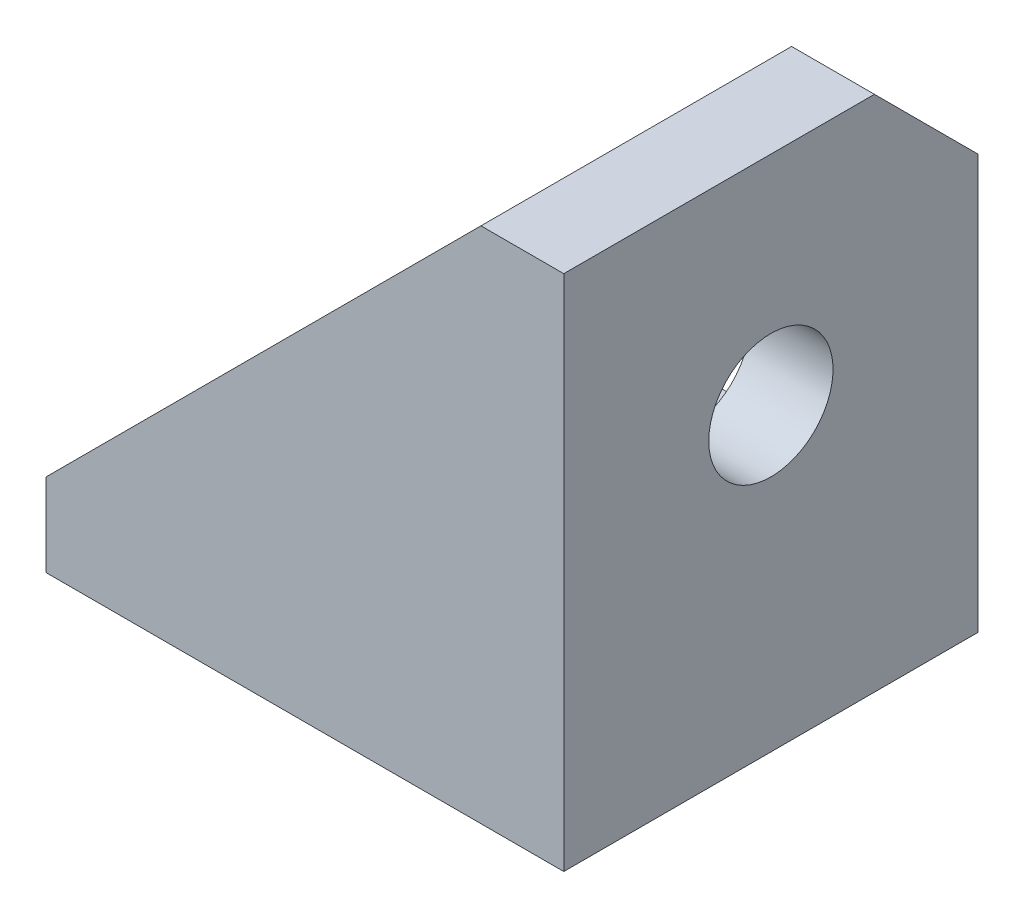
ISO-10303-21;
HEADER;
FILE_DESCRIPTION(('STEP AP214'),'2;1');
FILE_NAME('part.step','',(''),(''),'','','');
FILE_SCHEMA(('AUTOMOTIVE_DESIGN { 1 0 10303 214 1 1 1 1 }'));
ENDSEC;
DATA;
#1=APPLICATION_CONTEXT('core data for automotive mechanical design processes');
#2=APPLICATION_PROTOCOL_DEFINITION('international standard','automotive_design',2000,#1);
#3=PRODUCT_CONTEXT('',#1,'mechanical');
#4=PRODUCT('Part','Part','',(#3));
#5=PRODUCT_RELATED_PRODUCT_CATEGORY('part','',(#4));
#6=PRODUCT_DEFINITION_FORMATION('','',#4);
#7=PRODUCT_DEFINITION_CONTEXT('part definition',#1,'design');
#8=PRODUCT_DEFINITION('design','',#6,#7);
#9=PRODUCT_DEFINITION_SHAPE('','',#8);
#10=(LENGTH_UNIT() NAMED_UNIT(*) SI_UNIT(.MILLI.,.METRE.));
#11=(NAMED_UNIT(*) PLANE_ANGLE_UNIT() SI_UNIT($,.RADIAN.));
#12=(NAMED_UNIT(*) SI_UNIT($,.STERADIAN.) SOLID_ANGLE_UNIT());
#13=UNCERTAINTY_MEASURE_WITH_UNIT(LENGTH_MEASURE(1.E-05),#10,'distance_accuracy_value','');
#14=(GEOMETRIC_REPRESENTATION_CONTEXT(3) GLOBAL_UNCERTAINTY_ASSIGNED_CONTEXT((#13)) GLOBAL_UNIT_ASSIGNED_CONTEXT((#10,
#11,#12)) REPRESENTATION_CONTEXT('',''));
#15=CARTESIAN_POINT('',(0.,0.,0.));
#16=DIRECTION('',(0.,0.,1.));
#17=DIRECTION('',(1.,0.,0.));
#18=AXIS2_PLACEMENT_3D('',#15,#16,#17);
#19=CARTESIAN_POINT('',(-22.2500000000004,1010.,-9.00023424550686));
#20=DIRECTION('',(0.,-1.,0.));
#21=DIRECTION('',(0.,0.,1.));
#22=AXIS2_PLACEMENT_3D('',#19,#20,#21);
#23=PLANE('',#22);
#24=CARTESIAN_POINT('',(-32.75,1010.,0.999765754493011));
#25=DIRECTION('',(0.,1.,0.));
#26=DIRECTION('',(0.,0.,1.));
#27=AXIS2_PLACEMENT_3D('',#24,#25,#26);
#28=CIRCLE('',#27,2.99999999999999);
#29=CARTESIAN_POINT('',(-32.75,1010.,3.999765754493));
#30=VERTEX_POINT('',#29);
#31=EDGE_CURVE('E150',#30,#30,#28,.T.);
#32=ORIENTED_EDGE('',*,*,#31,.F.);
#33=EDGE_LOOP('',(#32));
#34=FACE_BOUND('',#33,.T.);
#35=DIRECTION('',(0.,0.,1.));
#36=VECTOR('',#35,1.);
#37=CARTESIAN_POINT('',(-43.25,1010.,-9.00023424550686));
#38=LINE('',#37,#36);
#39=CARTESIAN_POINT('',(-43.25,1010.,-4.00023424550683));
#40=VERTEX_POINT('',#39);
#41=CARTESIAN_POINT('',(-43.25,1010.,8.99976575449301));
#42=VERTEX_POINT('',#41);
#43=EDGE_CURVE('E156',#40,#42,#38,.T.);
#44=ORIENTED_EDGE('',*,*,#43,.T.);
#45=DIRECTION('',(1.,0.,0.));
#46=VECTOR('',#45,1.);
#47=CARTESIAN_POINT('',(-22.2500000000006,1010.,8.99976575449312));
#48=LINE('',#47,#46);
#49=CARTESIAN_POINT('',(-22.2500000000004,1010.,8.99976575449314));
#50=VERTEX_POINT('',#49);
#51=EDGE_CURVE('E137',#42,#50,#48,.T.);
#52=ORIENTED_EDGE('',*,*,#51,.T.);
#53=DIRECTION('',(0.,0.,1.));
#54=VECTOR('',#53,1.);
#55=CARTESIAN_POINT('',(-22.2500000000004,1010.,-9.00023424550686));
#56=LINE('',#55,#54);
#57=CARTESIAN_POINT('',(-22.2500000000004,1010.,-9.00023424550686));
#58=VERTEX_POINT('',#57);
#59=EDGE_CURVE('E159',#58,#50,#56,.T.);
#60=ORIENTED_EDGE('',*,*,#59,.F.);
#61=DIRECTION('',(-1.,0.,0.));
#62=VECTOR('',#61,1.);
#63=CARTESIAN_POINT('',(-22.2500000000004,1010.,-9.00023424550686));
#64=LINE('',#63,#62);
#65=CARTESIAN_POINT('',(-38.2499999999997,1010.,-9.00023424550686));
#66=VERTEX_POINT('',#65);
#67=EDGE_CURVE('E153',#58,#66,#64,.T.);
#68=ORIENTED_EDGE('',*,*,#67,.T.);
#69=DIRECTION('',(0.707106781186543,0.,-0.707106781186552));
#70=VECTOR('',#69,1.);
#71=CARTESIAN_POINT('',(-38.2499999999997,1010.,-9.00023424550684));
#72=LINE('',#71,#70);
#73=EDGE_CURVE('E43',#40,#66,#72,.T.);
#74=ORIENTED_EDGE('',*,*,#73,.F.);
#75=EDGE_LOOP('',(#44,#52,#60,#68,#74));
#76=FACE_BOUND('',#75,.T.);
#77=ADVANCED_FACE('F35',(#34,#76),#23,.F.);
#78=CARTESIAN_POINT('',(-22.2500000000004,1031.,-9.00023424550684));
#79=DIRECTION('',(1.,0.,0.));
#80=DIRECTION('',(0.,0.,1.));
#81=AXIS2_PLACEMENT_3D('',#78,#79,#80);
#82=PLANE('',#81);
#83=CARTESIAN_POINT('',(-22.2500000000004,1020.5,0.999765754493179));
#84=DIRECTION('',(-1.,0.,0.));
#85=DIRECTION('',(0.,0.,1.));
#86=AXIS2_PLACEMENT_3D('',#83,#84,#85);
#87=CIRCLE('',#86,2.99999999999989);
#88=CARTESIAN_POINT('',(-22.2500000000004,1020.5,3.99976575449307));
#89=VERTEX_POINT('',#88);
#90=EDGE_CURVE('E146',#89,#89,#87,.T.);
#91=ORIENTED_EDGE('',*,*,#90,.F.);
#92=EDGE_LOOP('',(#91));
#93=FACE_BOUND('',#92,.T.);
#94=DIRECTION('',(0.,-1.,0.));
#95=VECTOR('',#94,1.);
#96=CARTESIAN_POINT('',(-22.2500000000004,1031.,-9.00023424550684));
#97=LINE('',#96,#95);
#98=CARTESIAN_POINT('',(-22.2500000000004,1026.,-9.00023424550684));
#99=VERTEX_POINT('',#98);
#100=EDGE_CURVE('E151',#99,#58,#97,.T.);
#101=ORIENTED_EDGE('',*,*,#100,.T.);
#102=ORIENTED_EDGE('',*,*,#59,.T.);
#103=DIRECTION('',(0.,1.,0.));
#104=VECTOR('',#103,1.);
#105=CARTESIAN_POINT('',(-22.2500000000004,1031.,8.99976575449315));
#106=LINE('',#105,#104);
#107=CARTESIAN_POINT('',(-22.2500000000004,1031.,8.99976575449315));
#108=VERTEX_POINT('',#107);
#109=EDGE_CURVE('E172',#50,#108,#106,.T.);
#110=ORIENTED_EDGE('',*,*,#109,.T.);
#111=DIRECTION('',(0.,0.,1.));
#112=VECTOR('',#111,1.);
#113=CARTESIAN_POINT('',(-22.2500000000004,1031.,-9.00023424550684));
#114=LINE('',#113,#112);
#115=CARTESIAN_POINT('',(-22.2500000000004,1031.,-4.0002342455069));
#116=VERTEX_POINT('',#115);
#117=EDGE_CURVE('E162',#116,#108,#114,.T.);
#118=ORIENTED_EDGE('',*,*,#117,.F.);
#119=DIRECTION('',(0.,-0.707106781186546,-0.707106781186549));
#120=VECTOR('',#119,1.);
#121=CARTESIAN_POINT('',(-22.2500000000004,1031.,-4.0002342455069));
#122=LINE('',#121,#120);
#123=EDGE_CURVE('E190',#99,#116,#122,.F.);
#124=ORIENTED_EDGE('',*,*,#123,.F.);
#125=EDGE_LOOP('',(#101,#102,#110,#118,#124));
#126=FACE_BOUND('',#125,.T.);
#127=ADVANCED_FACE('F215',(#93,#126),#82,.F.);
#128=CARTESIAN_POINT('',(-43.2499999999996,1006.,-9.00023424550684));
#129=DIRECTION('',(0.,-1.,0.));
#130=DIRECTION('',(0.,0.,1.));
#131=AXIS2_PLACEMENT_3D('',#128,#129,#130);
#132=PLANE('',#131);
#133=DIRECTION('',(-1.,0.,0.));
#134=VECTOR('',#133,1.);
#135=CARTESIAN_POINT('',(-43.2499999999996,1006.,10.9997657544931));
#136=LINE('',#135,#134);
#137=CARTESIAN_POINT('',(-18.25,1006.,10.9997657544931));
#138=VERTEX_POINT('',#137);
#139=CARTESIAN_POINT('',(-43.2499999999996,1006.,10.9997657544931));
#140=VERTEX_POINT('',#139);
#141=EDGE_CURVE('E109',#138,#140,#136,.T.);
#142=ORIENTED_EDGE('',*,*,#141,.T.);
#143=DIRECTION('',(0.,0.,1.));
#144=VECTOR('',#143,1.);
#145=CARTESIAN_POINT('',(-43.2499999999996,1006.,-9.00023424550684));
#146=LINE('',#145,#144);
#147=CARTESIAN_POINT('',(-43.2499999999996,1006.,-4.00023424550684));
#148=VERTEX_POINT('',#147);
#149=EDGE_CURVE('E164',#148,#140,#146,.T.);
#150=ORIENTED_EDGE('',*,*,#149,.F.);
#151=DIRECTION('',(-0.707106781186543,0.,0.707106781186552));
#152=VECTOR('',#151,1.);
#153=CARTESIAN_POINT('',(-40.7499999999996,1006.,-6.50023424550687));
#154=LINE('',#153,#152);
#155=CARTESIAN_POINT('',(-38.2499999999997,1006.,-9.00023424550684));
#156=VERTEX_POINT('',#155);
#157=EDGE_CURVE('E184',#156,#148,#154,.T.);
#158=ORIENTED_EDGE('',*,*,#157,.F.);
#159=DIRECTION('',(1.,0.,0.));
#160=VECTOR('',#159,1.);
#161=CARTESIAN_POINT('',(-43.2499999999996,1006.,-9.00023424550684));
#162=LINE('',#161,#160);
#163=CARTESIAN_POINT('',(-18.25,1006.,-9.00023424550684));
#164=VERTEX_POINT('',#163);
#165=EDGE_CURVE('E167',#156,#164,#162,.T.);
#166=ORIENTED_EDGE('',*,*,#165,.T.);
#167=DIRECTION('',(0.,0.,1.));
#168=VECTOR('',#167,1.);
#169=CARTESIAN_POINT('',(-18.25,1006.,-9.00023424550684));
#170=LINE('',#169,#168);
#171=EDGE_CURVE('E123',#164,#138,#170,.T.);
#172=ORIENTED_EDGE('',*,*,#171,.T.);
#173=EDGE_LOOP('',(#142,#150,#158,#166,#172));
#174=FACE_BOUND('',#173,.T.);
#175=CARTESIAN_POINT('',(-32.75,1006.,0.999765754493011));
#176=DIRECTION('',(0.,1.,0.));
#177=DIRECTION('',(0.,0.,1.));
#178=AXIS2_PLACEMENT_3D('',#175,#176,#177);
#179=CIRCLE('',#178,2.99999999999999);
#180=CARTESIAN_POINT('',(-32.75,1006.,3.999765754493));
#181=VERTEX_POINT('',#180);
#182=EDGE_CURVE('E147',#181,#181,#179,.T.);
#183=ORIENTED_EDGE('',*,*,#182,.T.);
#184=EDGE_LOOP('',(#183));
#185=FACE_BOUND('',#184,.T.);
#186=ADVANCED_FACE('F205',(#174,#185),#132,.T.);
#187=CARTESIAN_POINT('',(-43.2499999999996,1031.,-9.00023424550681));
#188=DIRECTION('',(0.,0.,-1.));
#189=DIRECTION('',(0.,-1.,0.));
#190=AXIS2_PLACEMENT_3D('',#187,#188,#189);
#191=PLANE('',#190);
#192=DIRECTION('',(0.,-1.,0.));
#193=VECTOR('',#192,1.);
#194=CARTESIAN_POINT('',(-18.25,1031.,-9.00023424550681));
#195=LINE('',#194,#193);
#196=CARTESIAN_POINT('',(-18.25,1026.,-9.00023424550682));
#197=VERTEX_POINT('',#196);
#198=EDGE_CURVE('E122',#197,#164,#195,.T.);
#199=ORIENTED_EDGE('',*,*,#198,.T.);
#200=ORIENTED_EDGE('',*,*,#165,.F.);
#201=DIRECTION('',(0.,-1.,0.));
#202=VECTOR('',#201,1.);
#203=CARTESIAN_POINT('',(-38.2499999999997,1006.,-9.00023424550684));
#204=LINE('',#203,#202);
#205=EDGE_CURVE('E187',#66,#156,#204,.T.);
#206=ORIENTED_EDGE('',*,*,#205,.F.);
#207=ORIENTED_EDGE('',*,*,#67,.F.);
#208=ORIENTED_EDGE('',*,*,#100,.F.);
#209=DIRECTION('',(-1.,0.,0.));
#210=VECTOR('',#209,1.);
#211=CARTESIAN_POINT('',(-43.2499999999996,1026.,-9.00023424550682));
#212=LINE('',#211,#210);
#213=EDGE_CURVE('E56',#197,#99,#212,.T.);
#214=ORIENTED_EDGE('',*,*,#213,.F.);
#215=EDGE_LOOP('',(#199,#200,#206,#207,#208,#214));
#216=FACE_BOUND('',#215,.T.);
#217=ADVANCED_FACE('F201',(#216),#191,.T.);
#218=CARTESIAN_POINT('',(-43.2499999999996,1031.,30.9997657544932));
#219=DIRECTION('',(0.,1.,0.));
#220=DIRECTION('',(0.,0.,-1.));
#221=AXIS2_PLACEMENT_3D('',#218,#219,#220);
#222=PLANE('',#221);
#223=DIRECTION('',(1.,0.,0.));
#224=VECTOR('',#223,1.);
#225=CARTESIAN_POINT('',(-48.25,1031.,10.9997657544931));
#226=LINE('',#225,#224);
#227=CARTESIAN_POINT('',(-22.2500000000002,1031.,10.999765754493));
#228=VERTEX_POINT('',#227);
#229=CARTESIAN_POINT('',(-18.25,1031.,10.9997657544931));
#230=VERTEX_POINT('',#229);
#231=EDGE_CURVE('E107',#228,#230,#226,.T.);
#232=ORIENTED_EDGE('',*,*,#231,.T.);
#233=DIRECTION('',(0.,0.,-1.));
#234=VECTOR('',#233,1.);
#235=CARTESIAN_POINT('',(-18.25,1031.,30.9997657544932));
#236=LINE('',#235,#234);
#237=CARTESIAN_POINT('',(-18.25,1031.,-4.0002342455069));
#238=VERTEX_POINT('',#237);
#239=EDGE_CURVE('E115',#230,#238,#236,.T.);
#240=ORIENTED_EDGE('',*,*,#239,.T.);
#241=DIRECTION('',(1.,0.,0.));
#242=VECTOR('',#241,1.);
#243=CARTESIAN_POINT('',(-43.2499999999996,1031.,-4.0002342455069));
#244=LINE('',#243,#242);
#245=EDGE_CURVE('E180',#116,#238,#244,.T.);
#246=ORIENTED_EDGE('',*,*,#245,.F.);
#247=ORIENTED_EDGE('',*,*,#117,.T.);
#248=EDGE_CURVE('E129',#108,#228,#114,.T.);
#249=ORIENTED_EDGE('',*,*,#248,.T.);
#250=EDGE_LOOP('',(#232,#240,#246,#247,#249));
#251=FACE_BOUND('',#250,.T.);
#252=ADVANCED_FACE('F126',(#251),#222,.T.);
#253=CARTESIAN_POINT('',(-43.2499999999996,0.,0.));
#254=DIRECTION('',(1.,0.,0.));
#255=DIRECTION('',(0.,0.,1.));
#256=AXIS2_PLACEMENT_3D('',#253,#254,#255);
#257=PLANE('',#256);
#258=DIRECTION('',(0.,0.,1.));
#259=VECTOR('',#258,1.);
#260=CARTESIAN_POINT('',(-43.25,1010.,-9.00023424550708));
#261=LINE('',#260,#259);
#262=CARTESIAN_POINT('',(-43.2500000000002,1010.,10.9997657544929));
#263=VERTEX_POINT('',#262);
#264=EDGE_CURVE('E140',#42,#263,#261,.T.);
#265=ORIENTED_EDGE('',*,*,#264,.F.);
#266=ORIENTED_EDGE('',*,*,#43,.F.);
#267=DIRECTION('',(0.,1.,0.));
#268=VECTOR('',#267,1.);
#269=CARTESIAN_POINT('',(-43.2499999999996,1010.,-4.00023424550683));
#270=LINE('',#269,#268);
#271=EDGE_CURVE('E182',#148,#40,#270,.T.);
#272=ORIENTED_EDGE('',*,*,#271,.F.);
#273=ORIENTED_EDGE('',*,*,#149,.T.);
#274=DIRECTION('',(0.,-1.,0.));
#275=VECTOR('',#274,1.);
#276=CARTESIAN_POINT('',(-43.2499999999996,0.,10.9997657544931));
#277=LINE('',#276,#275);
#278=EDGE_CURVE('E130',#263,#140,#277,.T.);
#279=ORIENTED_EDGE('',*,*,#278,.F.);
#280=EDGE_LOOP('',(#265,#266,#272,#273,#279));
#281=FACE_BOUND('',#280,.T.);
#282=ADVANCED_FACE('F209',(#281),#257,.F.);
#283=CARTESIAN_POINT('',(-18.25,0.,0.));
#284=DIRECTION('',(1.,0.,0.));
#285=DIRECTION('',(0.,0.,1.));
#286=AXIS2_PLACEMENT_3D('',#283,#284,#285);
#287=PLANE('',#286);
#288=DIRECTION('',(0.,-1.,0.));
#289=VECTOR('',#288,1.);
#290=CARTESIAN_POINT('',(-18.25,1031.,10.9997657544931));
#291=LINE('',#290,#289);
#292=EDGE_CURVE('E103',#230,#138,#291,.T.);
#293=ORIENTED_EDGE('',*,*,#292,.T.);
#294=ORIENTED_EDGE('',*,*,#171,.F.);
#295=ORIENTED_EDGE('',*,*,#198,.F.);
#296=DIRECTION('',(0.,0.707106781186546,0.707106781186549));
#297=VECTOR('',#296,1.);
#298=CARTESIAN_POINT('',(-18.25,517.500117122756,-517.500117122754));
#299=LINE('',#298,#297);
#300=EDGE_CURVE('E119',#238,#197,#299,.F.);
#301=ORIENTED_EDGE('',*,*,#300,.F.);
#302=ORIENTED_EDGE('',*,*,#239,.F.);
#303=EDGE_LOOP('',(#293,#294,#295,#301,#302));
#304=FACE_BOUND('',#303,.T.);
#305=CARTESIAN_POINT('',(-18.25,1020.5,0.999765754493179));
#306=DIRECTION('',(-1.,0.,0.));
#307=DIRECTION('',(0.,0.,1.));
#308=AXIS2_PLACEMENT_3D('',#305,#306,#307);
#309=CIRCLE('',#308,2.99999999999989);
#310=CARTESIAN_POINT('',(-18.25,1020.5,3.99976575449307));
#311=VERTEX_POINT('',#310);
#312=EDGE_CURVE('E143',#311,#311,#309,.T.);
#313=ORIENTED_EDGE('',*,*,#312,.T.);
#314=EDGE_LOOP('',(#313));
#315=FACE_BOUND('',#314,.T.);
#316=ADVANCED_FACE('F116',(#304,#315),#287,.T.);
#317=CARTESIAN_POINT('',(-32.75,1006.,0.999765754493011));
#318=DIRECTION('',(0.,-1.,0.));
#319=DIRECTION('',(0.,0.,1.));
#320=AXIS2_PLACEMENT_3D('',#317,#318,#319);
#321=CYLINDRICAL_SURFACE('',#320,2.99999999999999);
#322=ORIENTED_EDGE('',*,*,#182,.F.);
#323=EDGE_LOOP('',(#322));
#324=FACE_BOUND('',#323,.T.);
#325=ORIENTED_EDGE('',*,*,#31,.T.);
#326=EDGE_LOOP('',(#325));
#327=FACE_BOUND('',#326,.T.);
#328=ADVANCED_FACE('F235',(#324,#327),#321,.F.);
#329=CARTESIAN_POINT('',(-18.25,1020.5,0.999765754493179));
#330=DIRECTION('',(1.,0.,0.));
#331=DIRECTION('',(0.,0.,1.));
#332=AXIS2_PLACEMENT_3D('',#329,#330,#331);
#333=CYLINDRICAL_SURFACE('',#332,2.99999999999989);
#334=ORIENTED_EDGE('',*,*,#312,.F.);
#335=EDGE_LOOP('',(#334));
#336=FACE_BOUND('',#335,.T.);
#337=ORIENTED_EDGE('',*,*,#90,.T.);
#338=EDGE_LOOP('',(#337));
#339=FACE_BOUND('',#338,.T.);
#340=ADVANCED_FACE('F272',(#336,#339),#333,.F.);
#341=CARTESIAN_POINT('',(-43.2500000000002,1010.,10.9997657544929));
#342=DIRECTION('',(-0.707106781186546,0.707106781186549,0.));
#343=DIRECTION('',(0.707106781186549,0.707106781186546,0.));
#344=AXIS2_PLACEMENT_3D('',#341,#342,#343);
#345=PLANE('',#344);
#346=DIRECTION('',(0.707106781186549,0.707106781186546,0.));
#347=VECTOR('',#346,1.);
#348=CARTESIAN_POINT('',(-43.2500000000002,1010.,10.9997657544929));
#349=LINE('',#348,#347);
#350=EDGE_CURVE('E11',#263,#228,#349,.T.);
#351=ORIENTED_EDGE('',*,*,#350,.T.);
#352=ORIENTED_EDGE('',*,*,#248,.F.);
#353=DIRECTION('',(0.707106781186549,0.707106781186546,0.));
#354=VECTOR('',#353,1.);
#355=CARTESIAN_POINT('',(-43.2500000000001,1010.,8.9997657544929));
#356=LINE('',#355,#354);
#357=EDGE_CURVE('E135',#42,#108,#356,.T.);
#358=ORIENTED_EDGE('',*,*,#357,.F.);
#359=ORIENTED_EDGE('',*,*,#264,.T.);
#360=EDGE_LOOP('',(#351,#352,#358,#359));
#361=FACE_BOUND('',#360,.T.);
#362=ADVANCED_FACE('F222',(#361),#345,.T.);
#363=CARTESIAN_POINT('',(-30.75,1018.5,8.99976575449304));
#364=DIRECTION('',(0.,0.,1.));
#365=DIRECTION('',(-1.,0.,0.));
#366=AXIS2_PLACEMENT_3D('',#363,#364,#365);
#367=PLANE('',#366);
#368=ORIENTED_EDGE('',*,*,#357,.T.);
#369=ORIENTED_EDGE('',*,*,#109,.F.);
#370=ORIENTED_EDGE('',*,*,#51,.F.);
#371=EDGE_LOOP('',(#368,#369,#370));
#372=FACE_BOUND('',#371,.T.);
#373=ADVANCED_FACE('F212',(#372),#367,.F.);
#374=CARTESIAN_POINT('',(-43.2499999999996,1031.,-4.0002342455069));
#375=DIRECTION('',(0.,-0.707106781186549,0.707106781186546));
#376=DIRECTION('',(1.,0.,0.));
#377=AXIS2_PLACEMENT_3D('',#374,#375,#376);
#378=PLANE('',#377);
#379=ORIENTED_EDGE('',*,*,#123,.T.);
#380=ORIENTED_EDGE('',*,*,#245,.T.);
#381=ORIENTED_EDGE('',*,*,#300,.T.);
#382=ORIENTED_EDGE('',*,*,#213,.T.);
#383=EDGE_LOOP('',(#379,#380,#381,#382));
#384=FACE_BOUND('',#383,.T.);
#385=ADVANCED_FACE('F216',(#384),#378,.F.);
#386=CARTESIAN_POINT('',(-38.2499999999997,1031.,-9.00023424550681));
#387=DIRECTION('',(-0.707106781186552,0.,-0.707106781186543));
#388=DIRECTION('',(0.,1.,0.));
#389=AXIS2_PLACEMENT_3D('',#386,#387,#388);
#390=PLANE('',#389);
#391=ORIENTED_EDGE('',*,*,#73,.T.);
#392=ORIENTED_EDGE('',*,*,#205,.T.);
#393=ORIENTED_EDGE('',*,*,#157,.T.);
#394=ORIENTED_EDGE('',*,*,#271,.T.);
#395=EDGE_LOOP('',(#391,#392,#393,#394));
#396=FACE_BOUND('',#395,.T.);
#397=ADVANCED_FACE('F37',(#396),#390,.T.);
#398=CARTESIAN_POINT('',(-48.25,1031.,10.9997657544931));
#399=DIRECTION('',(0.,0.,-1.));
#400=DIRECTION('',(1.,0.,0.));
#401=AXIS2_PLACEMENT_3D('',#398,#399,#400);
#402=PLANE('',#401);
#403=ORIENTED_EDGE('',*,*,#141,.F.);
#404=ORIENTED_EDGE('',*,*,#292,.F.);
#405=ORIENTED_EDGE('',*,*,#231,.F.);
#406=ORIENTED_EDGE('',*,*,#350,.F.);
#407=ORIENTED_EDGE('',*,*,#278,.T.);
#408=EDGE_LOOP('',(#403,#404,#405,#406,#407));
#409=FACE_BOUND('',#408,.T.);
#410=ADVANCED_FACE('F105',(#409),#402,.F.);
#411=CLOSED_SHELL('',(#77,#127,#186,#217,#252,#282,#316,#328,#340,#362,#373,#385,#397,#410));
#412=MANIFOLD_SOLID_BREP('B2',#411);
#413=ADVANCED_BREP_SHAPE_REPRESENTATION('',(#18,#412),#14);
#414=SHAPE_DEFINITION_REPRESENTATION(#9,#413);
ENDSEC;
END-ISO-10303-21;
